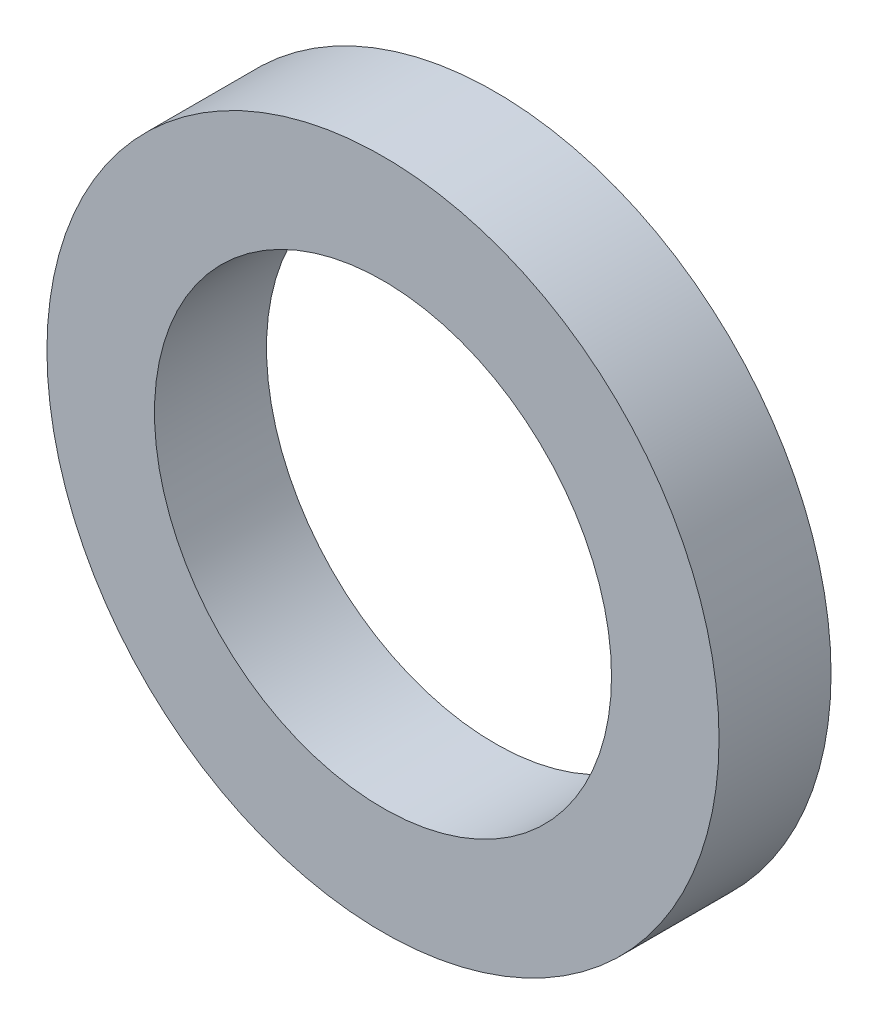
ISO-10303-21;
HEADER;
FILE_DESCRIPTION(('STEP AP214'),'2;1');
FILE_NAME('part.step','',(''),(''),'','','');
FILE_SCHEMA(('AUTOMOTIVE_DESIGN { 1 0 10303 214 1 1 1 1 }'));
ENDSEC;
DATA;
#1=APPLICATION_CONTEXT('core data for automotive mechanical design processes');
#2=APPLICATION_PROTOCOL_DEFINITION('international standard','automotive_design',2000,#1);
#3=PRODUCT_CONTEXT('',#1,'mechanical');
#4=PRODUCT('Part','Part','',(#3));
#5=PRODUCT_RELATED_PRODUCT_CATEGORY('part','',(#4));
#6=PRODUCT_DEFINITION_FORMATION('','',#4);
#7=PRODUCT_DEFINITION_CONTEXT('part definition',#1,'design');
#8=PRODUCT_DEFINITION('design','',#6,#7);
#9=PRODUCT_DEFINITION_SHAPE('','',#8);
#10=(LENGTH_UNIT() NAMED_UNIT(*) SI_UNIT(.MILLI.,.METRE.));
#11=(NAMED_UNIT(*) PLANE_ANGLE_UNIT() SI_UNIT($,.RADIAN.));
#12=(NAMED_UNIT(*) SI_UNIT($,.STERADIAN.) SOLID_ANGLE_UNIT());
#13=UNCERTAINTY_MEASURE_WITH_UNIT(LENGTH_MEASURE(1.E-05),#10,'distance_accuracy_value','');
#14=(GEOMETRIC_REPRESENTATION_CONTEXT(3) GLOBAL_UNCERTAINTY_ASSIGNED_CONTEXT((#13)) GLOBAL_UNIT_ASSIGNED_CONTEXT((#10,
#11,#12)) REPRESENTATION_CONTEXT('',''));
#15=CARTESIAN_POINT('',(0.,0.,0.));
#16=DIRECTION('',(0.,0.,1.));
#17=DIRECTION('',(1.,0.,0.));
#18=AXIS2_PLACEMENT_3D('',#15,#16,#17);
#19=CARTESIAN_POINT('',(0.,0.,3.175));
#20=DIRECTION('',(0.,0.,1.));
#21=DIRECTION('',(1.,0.,0.));
#22=AXIS2_PLACEMENT_3D('',#19,#20,#21);
#23=PLANE('',#22);
#24=CARTESIAN_POINT('',(0.,0.,3.175));
#25=DIRECTION('',(0.,0.,1.));
#26=DIRECTION('',(1.,0.,0.));
#27=AXIS2_PLACEMENT_3D('',#24,#25,#26);
#28=CIRCLE('',#27,9.525);
#29=CARTESIAN_POINT('',(9.525,0.,3.175));
#30=VERTEX_POINT('',#29);
#31=EDGE_CURVE('E10',#30,#30,#28,.T.);
#32=ORIENTED_EDGE('',*,*,#31,.T.);
#33=EDGE_LOOP('',(#32));
#34=FACE_BOUND('',#33,.T.);
#35=CARTESIAN_POINT('',(0.,0.,3.175));
#36=DIRECTION('',(0.,0.,1.));
#37=DIRECTION('',(1.,0.,0.));
#38=AXIS2_PLACEMENT_3D('',#35,#36,#37);
#39=CIRCLE('',#38,6.477);
#40=CARTESIAN_POINT('',(6.477,0.,3.175));
#41=VERTEX_POINT('',#40);
#42=EDGE_CURVE('E42',#41,#41,#39,.T.);
#43=ORIENTED_EDGE('',*,*,#42,.F.);
#44=EDGE_LOOP('',(#43));
#45=FACE_BOUND('',#44,.T.);
#46=ADVANCED_FACE('F31',(#34,#45),#23,.T.);
#47=CARTESIAN_POINT('',(0.,0.,0.));
#48=DIRECTION('',(0.,0.,1.));
#49=DIRECTION('',(1.,0.,0.));
#50=AXIS2_PLACEMENT_3D('',#47,#48,#49);
#51=PLANE('',#50);
#52=CARTESIAN_POINT('',(0.,0.,0.));
#53=DIRECTION('',(0.,0.,1.));
#54=DIRECTION('',(1.,0.,0.));
#55=AXIS2_PLACEMENT_3D('',#52,#53,#54);
#56=CIRCLE('',#55,9.525);
#57=CARTESIAN_POINT('',(9.525,0.,0.));
#58=VERTEX_POINT('',#57);
#59=EDGE_CURVE('E35',#58,#58,#56,.T.);
#60=ORIENTED_EDGE('',*,*,#59,.F.);
#61=EDGE_LOOP('',(#60));
#62=FACE_BOUND('',#61,.T.);
#63=CARTESIAN_POINT('',(0.,0.,0.));
#64=DIRECTION('',(0.,0.,1.));
#65=DIRECTION('',(1.,0.,0.));
#66=AXIS2_PLACEMENT_3D('',#63,#64,#65);
#67=CIRCLE('',#66,6.477);
#68=CARTESIAN_POINT('',(6.477,0.,0.));
#69=VERTEX_POINT('',#68);
#70=EDGE_CURVE('E44',#69,#69,#67,.T.);
#71=ORIENTED_EDGE('',*,*,#70,.T.);
#72=EDGE_LOOP('',(#71));
#73=FACE_BOUND('',#72,.T.);
#74=ADVANCED_FACE('F54',(#62,#73),#51,.F.);
#75=CARTESIAN_POINT('',(0.,0.,3.175));
#76=DIRECTION('',(0.,0.,-1.));
#77=DIRECTION('',(-1.,0.,0.));
#78=AXIS2_PLACEMENT_3D('',#75,#76,#77);
#79=CYLINDRICAL_SURFACE('',#78,9.525);
#80=ORIENTED_EDGE('',*,*,#31,.F.);
#81=EDGE_LOOP('',(#80));
#82=FACE_BOUND('',#81,.T.);
#83=ORIENTED_EDGE('',*,*,#59,.T.);
#84=EDGE_LOOP('',(#83));
#85=FACE_BOUND('',#84,.T.);
#86=ADVANCED_FACE('F33',(#82,#85),#79,.T.);
#87=CARTESIAN_POINT('',(0.,0.,3.175));
#88=DIRECTION('',(0.,0.,-1.));
#89=DIRECTION('',(-1.,0.,0.));
#90=AXIS2_PLACEMENT_3D('',#87,#88,#89);
#91=CYLINDRICAL_SURFACE('',#90,6.477);
#92=ORIENTED_EDGE('',*,*,#42,.T.);
#93=EDGE_LOOP('',(#92));
#94=FACE_BOUND('',#93,.T.);
#95=ORIENTED_EDGE('',*,*,#70,.F.);
#96=EDGE_LOOP('',(#95));
#97=FACE_BOUND('',#96,.T.);
#98=ADVANCED_FACE('F50',(#94,#97),#91,.F.);
#99=CLOSED_SHELL('',(#46,#74,#86,#98));
#100=MANIFOLD_SOLID_BREP('B2',#99);
#101=ADVANCED_BREP_SHAPE_REPRESENTATION('',(#18,#100),#14);
#102=SHAPE_DEFINITION_REPRESENTATION(#9,#101);
ENDSEC;
END-ISO-10303-21;
